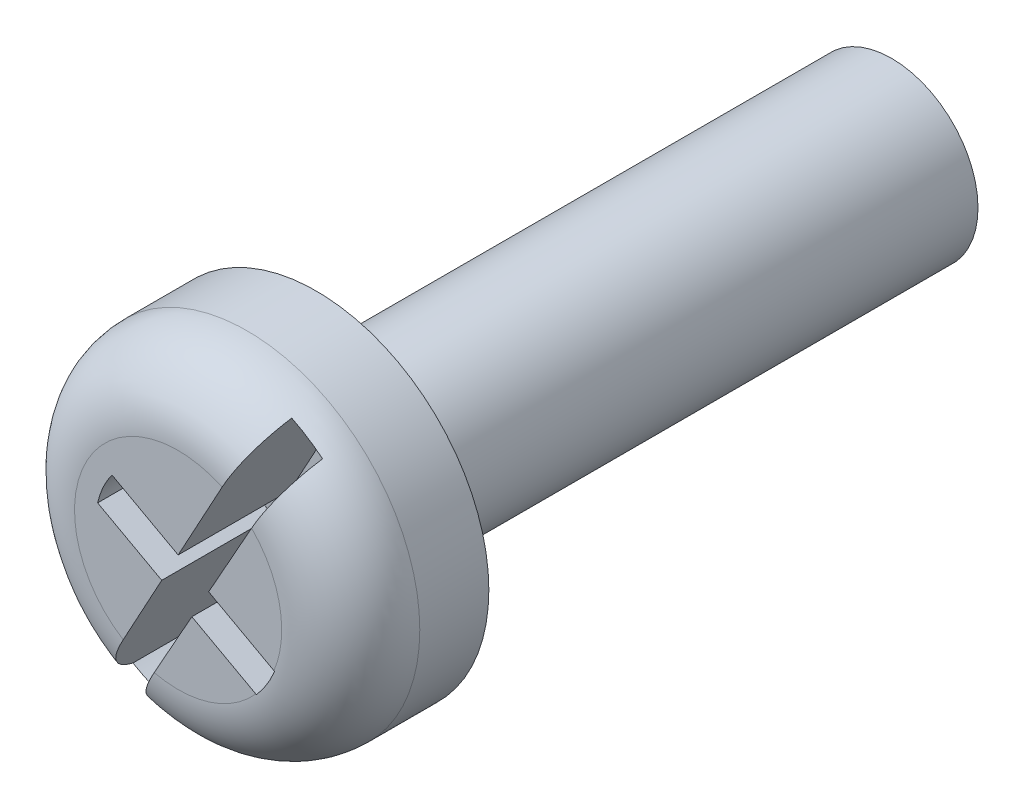
ISO-10303-21;
HEADER;
FILE_DESCRIPTION(('STEP AP214'),'2;1');
FILE_NAME('part.step','',(''),(''),'','','');
FILE_SCHEMA(('AUTOMOTIVE_DESIGN { 1 0 10303 214 1 1 1 1 }'));
ENDSEC;
DATA;
#1=APPLICATION_CONTEXT('core data for automotive mechanical design processes');
#2=APPLICATION_PROTOCOL_DEFINITION('international standard','automotive_design',2000,#1);
#3=PRODUCT_CONTEXT('',#1,'mechanical');
#4=PRODUCT('Part','Part','',(#3));
#5=PRODUCT_RELATED_PRODUCT_CATEGORY('part','',(#4));
#6=PRODUCT_DEFINITION_FORMATION('','',#4);
#7=PRODUCT_DEFINITION_CONTEXT('part definition',#1,'design');
#8=PRODUCT_DEFINITION('design','',#6,#7);
#9=PRODUCT_DEFINITION_SHAPE('','',#8);
#10=(LENGTH_UNIT() NAMED_UNIT(*) SI_UNIT(.MILLI.,.METRE.));
#11=(NAMED_UNIT(*) PLANE_ANGLE_UNIT() SI_UNIT($,.RADIAN.));
#12=(NAMED_UNIT(*) SI_UNIT($,.STERADIAN.) SOLID_ANGLE_UNIT());
#13=UNCERTAINTY_MEASURE_WITH_UNIT(LENGTH_MEASURE(1.E-05),#10,'distance_accuracy_value','');
#14=(GEOMETRIC_REPRESENTATION_CONTEXT(3) GLOBAL_UNCERTAINTY_ASSIGNED_CONTEXT((#13)) GLOBAL_UNIT_ASSIGNED_CONTEXT((#10,
#11,#12)) REPRESENTATION_CONTEXT('',''));
#15=CARTESIAN_POINT('',(0.,0.,0.));
#16=DIRECTION('',(0.,0.,1.));
#17=DIRECTION('',(1.,0.,0.));
#18=AXIS2_PLACEMENT_3D('',#15,#16,#17);
#19=CARTESIAN_POINT('',(-1.86051624597212,2.73214285714287,2.4));
#20=DIRECTION('',(0.,0.,1.));
#21=DIRECTION('',(1.,0.,0.));
#22=AXIS2_PLACEMENT_3D('',#19,#20,#21);
#23=PLANE('',#22);
#24=DIRECTION('',(-0.478292119632489,-0.87820080180871,0.));
#25=VECTOR('',#24,1.);
#26=CARTESIAN_POINT('',(-3.33454353016391,0.250826496084395,2.4));
#27=LINE('',#26,#25);
#28=CARTESIAN_POINT('',(-2.14514294385762,2.43470640062586,2.4));
#29=VERTEX_POINT('',#28);
#30=CARTESIAN_POINT('',(-2.8144800366458,1.20572447213714,2.4));
#31=VERTEX_POINT('',#30);
#32=EDGE_CURVE('E166',#29,#31,#27,.T.);
#33=ORIENTED_EDGE('',*,*,#32,.F.);
#34=DIRECTION('',(0.877616803209732,-0.479362854968896,0.));
#35=VECTOR('',#34,1.);
#36=CARTESIAN_POINT('',(-2.14514294385762,2.43470640062586,2.4));
#37=LINE('',#36,#35);
#38=CARTESIAN_POINT('',(-3.25868789679237,3.04293551135249,2.4));
#39=VERTEX_POINT('',#38);
#40=EDGE_CURVE('E168',#39,#29,#37,.T.);
#41=ORIENTED_EDGE('',*,*,#40,.F.);
#42=CARTESIAN_POINT('',(-1.86051624597212,2.73214285714287,2.4));
#43=DIRECTION('',(0.,0.,1.));
#44=DIRECTION('',(1.,0.,0.));
#45=AXIS2_PLACEMENT_3D('',#42,#43,#44);
#46=CIRCLE('',#45,1.43229746877807);
#47=CARTESIAN_POINT('',(-3.00946383602339,3.58735948138695,2.4));
#48=VERTEX_POINT('',#47);
#49=EDGE_CURVE('E209',#48,#39,#46,.T.);
#50=ORIENTED_EDGE('',*,*,#49,.F.);
#51=DIRECTION('',(-0.87756139574922,0.479464280933086,0.));
#52=VECTOR('',#51,1.);
#53=CARTESIAN_POINT('',(-1.85954831796557,2.95909185285404,2.4));
#54=LINE('',#53,#52);
#55=CARTESIAN_POINT('',(-1.85954831796557,2.95909185285404,2.4));
#56=VERTEX_POINT('',#55);
#57=EDGE_CURVE('E206',#56,#48,#54,.T.);
#58=ORIENTED_EDGE('',*,*,#57,.F.);
#59=DIRECTION('',(-0.478292119632489,-0.87820080180871,0.));
#60=VECTOR('',#59,1.);
#61=CARTESIAN_POINT('',(-1.85954831796557,2.95909185285404,2.4));
#62=LINE('',#61,#60);
#63=CARTESIAN_POINT('',(-1.09571318629089,4.36158333776873,2.4));
#64=VERTEX_POINT('',#63);
#65=EDGE_CURVE('E204',#64,#56,#62,.T.);
#66=ORIENTED_EDGE('',*,*,#65,.F.);
#67=CARTESIAN_POINT('',(-1.86051624597212,2.73214285714287,2.4));
#68=DIRECTION('',(0.,0.,1.));
#69=DIRECTION('',(1.,0.,0.));
#70=AXIS2_PLACEMENT_3D('',#67,#68,#69);
#71=CIRCLE('',#70,1.8);
#72=EDGE_CURVE('E254',#64,#31,#71,.T.);
#73=ORIENTED_EDGE('',*,*,#72,.T.);
#74=EDGE_LOOP('',(#33,#41,#50,#58,#66,#73));
#75=FACE_BOUND('',#74,.T.);
#76=ADVANCED_FACE('F34',(#75),#23,.T.);
#77=DIRECTION('',(0.488945551082672,0.872314305784596,0.));
#78=VECTOR('',#77,1.);
#79=CARTESIAN_POINT('',(-1.32937302466549,2.66942537823253,2.4));
#80=LINE('',#79,#78);
#81=CARTESIAN_POINT('',(-1.32937302466549,2.66942537823253,2.4));
#82=VERTEX_POINT('',#81);
#83=CARTESIAN_POINT('',(-0.583292168991765,4.00048770661469,2.4));
#84=VERTEX_POINT('',#83);
#85=EDGE_CURVE('E202',#82,#84,#80,.T.);
#86=ORIENTED_EDGE('',*,*,#85,.F.);
#87=DIRECTION('',(-0.87756139574922,0.479464280933086,0.));
#88=VECTOR('',#87,1.);
#89=CARTESIAN_POINT('',(-0.183967514701797,2.04362183688296,2.4));
#90=LINE('',#89,#88);
#91=CARTESIAN_POINT('',(-0.194936591049152,2.04961489939557,2.4));
#92=VERTEX_POINT('',#91);
#93=EDGE_CURVE('E200',#92,#82,#90,.T.);
#94=ORIENTED_EDGE('',*,*,#93,.F.);
#95=EDGE_CURVE('E250',#92,#84,#71,.T.);
#96=ORIENTED_EDGE('',*,*,#95,.T.);
#97=EDGE_LOOP('',(#86,#94,#96));
#98=FACE_BOUND('',#97,.T.);
#99=ADVANCED_FACE('F289',(#98),#23,.T.);
#100=CARTESIAN_POINT('',(-1.86051624597212,2.73214285714287,2.4));
#101=DIRECTION('',(0.,0.,-1.));
#102=DIRECTION('',(-1.,0.,0.));
#103=AXIS2_PLACEMENT_3D('',#100,#101,#102);
#104=CYLINDRICAL_SURFACE('',#103,3.);
#105=CARTESIAN_POINT('',(-1.86051624597212,2.73214285714287,1.2));
#106=DIRECTION('',(0.,0.,1.));
#107=DIRECTION('',(1.,0.,0.));
#108=AXIS2_PLACEMENT_3D('',#105,#106,#107);
#109=CIRCLE('',#108,3.);
#110=CARTESIAN_POINT('',(1.13948375402788,2.73214285714287,1.2));
#111=VERTEX_POINT('',#110);
#112=EDGE_CURVE('E255',#111,#111,#109,.F.);
#113=ORIENTED_EDGE('',*,*,#112,.T.);
#114=EDGE_LOOP('',(#113));
#115=FACE_BOUND('',#114,.T.);
#116=CARTESIAN_POINT('',(-1.86051624597212,2.73214285714287,0.));
#117=DIRECTION('',(0.,0.,1.));
#118=DIRECTION('',(1.,0.,0.));
#119=AXIS2_PLACEMENT_3D('',#116,#117,#118);
#120=CIRCLE('',#119,3.);
#121=CARTESIAN_POINT('',(1.13948375402788,2.73214285714287,0.));
#122=VERTEX_POINT('',#121);
#123=EDGE_CURVE('E244',#122,#122,#120,.T.);
#124=ORIENTED_EDGE('',*,*,#123,.T.);
#125=EDGE_LOOP('',(#124));
#126=FACE_BOUND('',#125,.T.);
#127=ADVANCED_FACE('F287',(#115,#126),#104,.T.);
#128=DIRECTION('',(0.877616803209732,-0.479362854968895,0.));
#129=VECTOR('',#128,1.);
#130=CARTESIAN_POINT('',(-0.499159615510704,1.53565425779784,2.4));
#131=LINE('',#130,#129);
#132=CARTESIAN_POINT('',(-1.62131210840641,2.14858489077753,2.4));
#133=VERTEX_POINT('',#132);
#134=CARTESIAN_POINT('',(-0.510336160729363,1.54175899577131,2.4));
#135=VERTEX_POINT('',#134);
#136=EDGE_CURVE('E198',#133,#135,#131,.T.);
#137=ORIENTED_EDGE('',*,*,#136,.F.);
#138=DIRECTION('',(0.488945551082672,0.872314305784596,0.));
#139=VECTOR('',#138,1.);
#140=CARTESIAN_POINT('',(-2.81993360779638,0.0101572502690064,2.4));
#141=LINE('',#140,#139);
#142=CARTESIAN_POINT('',(-2.27591252151725,0.980730303155878,2.4));
#143=VERTEX_POINT('',#142);
#144=EDGE_CURVE('E196',#143,#133,#141,.T.);
#145=ORIENTED_EDGE('',*,*,#144,.F.);
#146=EDGE_CURVE('E253',#143,#135,#71,.T.);
#147=ORIENTED_EDGE('',*,*,#146,.T.);
#148=EDGE_LOOP('',(#137,#145,#147));
#149=FACE_BOUND('',#148,.T.);
#150=ADVANCED_FACE('F284',(#149),#23,.T.);
#151=CARTESIAN_POINT('',(-1.86051624597212,2.73214285714287,0.));
#152=DIRECTION('',(0.,0.,1.));
#153=DIRECTION('',(1.,0.,0.));
#154=AXIS2_PLACEMENT_3D('',#151,#152,#153);
#155=PLANE('',#154);
#156=CARTESIAN_POINT('',(-1.86051624597212,2.73214285714287,0.));
#157=DIRECTION('',(0.,0.,1.));
#158=DIRECTION('',(1.,0.,0.));
#159=AXIS2_PLACEMENT_3D('',#156,#157,#158);
#160=CIRCLE('',#159,1.5);
#161=CARTESIAN_POINT('',(-0.360516245972119,2.73214285714287,0.));
#162=VERTEX_POINT('',#161);
#163=EDGE_CURVE('E247',#162,#162,#160,.F.);
#164=ORIENTED_EDGE('',*,*,#163,.F.);
#165=EDGE_LOOP('',(#164));
#166=FACE_BOUND('',#165,.T.);
#167=ORIENTED_EDGE('',*,*,#123,.F.);
#168=EDGE_LOOP('',(#167));
#169=FACE_BOUND('',#168,.T.);
#170=ADVANCED_FACE('F282',(#166,#169),#155,.F.);
#171=CARTESIAN_POINT('',(-1.86051624597212,2.73214285714287,-10.));
#172=DIRECTION('',(0.,0.,1.));
#173=DIRECTION('',(1.,0.,0.));
#174=AXIS2_PLACEMENT_3D('',#171,#172,#173);
#175=CYLINDRICAL_SURFACE('',#174,1.5);
#176=CARTESIAN_POINT('',(-1.86051624597212,2.73214285714287,-10.));
#177=DIRECTION('',(0.,0.,-1.));
#178=DIRECTION('',(-1.,0.,0.));
#179=AXIS2_PLACEMENT_3D('',#176,#177,#178);
#180=CIRCLE('',#179,1.5);
#181=CARTESIAN_POINT('',(-3.36051624597212,2.73214285714287,-10.));
#182=VERTEX_POINT('',#181);
#183=EDGE_CURVE('E216',#182,#182,#180,.T.);
#184=ORIENTED_EDGE('',*,*,#183,.F.);
#185=EDGE_LOOP('',(#184));
#186=FACE_BOUND('',#185,.T.);
#187=ORIENTED_EDGE('',*,*,#163,.T.);
#188=EDGE_LOOP('',(#187));
#189=FACE_BOUND('',#188,.T.);
#190=ADVANCED_FACE('F278',(#186,#189),#175,.T.);
#191=CARTESIAN_POINT('',(-1.86051624597212,2.73214285714287,-10.));
#192=DIRECTION('',(0.,0.,-1.));
#193=DIRECTION('',(-1.,0.,0.));
#194=AXIS2_PLACEMENT_3D('',#191,#192,#193);
#195=PLANE('',#194);
#196=ORIENTED_EDGE('',*,*,#183,.T.);
#197=EDGE_LOOP('',(#196));
#198=FACE_BOUND('',#197,.T.);
#199=ADVANCED_FACE('F275',(#198),#195,.T.);
#200=CARTESIAN_POINT('',(-1.86051624597212,2.73214285714287,1.2));
#201=DIRECTION('',(0.,0.,1.));
#202=DIRECTION('',(1.,0.,0.));
#203=AXIS2_PLACEMENT_3D('',#200,#201,#202);
#204=TOROIDAL_SURFACE('',#203,1.8,1.2);
#205=CARTESIAN_POINT('',(-0.575540767315494,5.31668131382147,1.70975429270533));
#206=CARTESIAN_POINT('',(-0.5824043740871,5.3040789214284,1.74031456902629));
#207=CARTESIAN_POINT('',(-0.58988200536983,5.29034910753732,1.77025412843296));
#208=CARTESIAN_POINT('',(-0.606016263850412,5.26072470405536,1.82870871238285));
#209=CARTESIAN_POINT('',(-0.614672831189766,5.24483022437174,1.85722380915036));
#210=CARTESIAN_POINT('',(-0.642308509018158,5.19408785703759,1.94027220578123));
#211=CARTESIAN_POINT('',(-0.6629762437161,5.15613945596996,1.99240919048908));
#212=CARTESIAN_POINT('',(-0.708203159379022,5.07309749903989,2.08868631517981));
#213=CARTESIAN_POINT('',(-0.732764089691729,5.02800073116848,2.1328228410772));
#214=CARTESIAN_POINT('',(-0.785077689775711,4.931946784943,2.21185265354796));
#215=CARTESIAN_POINT('',(-0.812829752078776,4.88099072197227,2.24674769517889));
#216=CARTESIAN_POINT('',(-0.870755055483799,4.77463302589651,2.30632883547805));
#217=CARTESIAN_POINT('',(-0.900929651552919,4.71922890491179,2.33100917270618));
#218=CARTESIAN_POINT('',(-0.96283568336023,4.6055621214997,2.3694469225507));
#219=CARTESIAN_POINT('',(-0.994567368093604,4.54729900188777,2.38320258211041));
#220=CARTESIAN_POINT('',(-1.05872386347642,4.42950010164723,2.39941483191493));
#221=CARTESIAN_POINT('',(-1.09114948115231,4.36996283922278,2.40185745763308));
#222=CARTESIAN_POINT('',(-1.15573526747496,4.25137571013191,2.3953503202161));
#223=CARTESIAN_POINT('',(-1.18789545531375,4.19232580822668,2.38640138814567));
#224=CARTESIAN_POINT('',(-1.25111142223883,4.07625382927923,2.35735083248507));
#225=CARTESIAN_POINT('',(-1.28216478936063,4.01923618088856,2.33722626866415));
#226=CARTESIAN_POINT('',(-1.34222441899033,3.90895960987239,2.28639254421336));
#227=CARTESIAN_POINT('',(-1.37123050343914,3.85570101418436,2.25568246428877));
#228=CARTESIAN_POINT('',(-1.42645974489832,3.75429360615512,2.18445449366384));
#229=CARTESIAN_POINT('',(-1.45267457095233,3.7061600904334,2.14390836466459));
#230=CARTESIAN_POINT('',(-1.50148430909094,3.6165396484275,2.05421363754392));
#231=CARTESIAN_POINT('',(-1.52407946375269,3.57505227674305,2.00506561635217));
#232=CARTESIAN_POINT('',(-1.56505668794341,3.49981325510113,1.89942416088343));
#233=CARTESIAN_POINT('',(-1.58342918956016,3.46607917296016,1.84291449103487));
#234=CARTESIAN_POINT('',(-1.61535277583557,3.40746369945995,1.72423224566163));
#235=CARTESIAN_POINT('',(-1.62890390546596,3.38258222552731,1.66205972296445));
#236=CARTESIAN_POINT('',(-1.65068064383632,3.3425975627812,1.53419605152068));
#237=CARTESIAN_POINT('',(-1.65894166858414,3.32742934599587,1.46853155927476));
#238=CARTESIAN_POINT('',(-1.66723338993673,3.31220476661996,1.36857431614967));
#239=CARTESIAN_POINT('',(-1.66931401785529,3.30838448810952,1.33497508943135));
#240=CARTESIAN_POINT('',(-1.67209007621539,3.30328731720154,1.26752282072818));
#241=CARTESIAN_POINT('',(-1.67278531621524,3.30201077447743,1.23366974448996));
#242=CARTESIAN_POINT('',(-1.67278220669648,3.302016483921,1.1998));
#243=B_SPLINE_CURVE_WITH_KNOTS('',3,(#205,#206,#207,#208,#209,#210,#211,#212,#213,#214,#215,
#216,#217,#218,#219,#220,#221,#222,#223,#224,#225,#226,#227,#228,#229,#230,#231,#232,#233,#234,
#235,#236,#237,#238,#239,#240,#241,#242),.UNSPECIFIED.,.F.,.F.,(4,2,2,2,2,2,2,2,2,2,2,2,2,2,2,2,
2,2,4),(0.,0.101223158894359,0.202441180267574,0.404547966509414,0.606745825117994,
0.808905256591363,1.01117855796459,1.21348431109243,1.41603971895592,1.61858035035038,
1.82153828216889,2.02451384422666,2.22807917195367,2.43163085176484,2.63563930015266,
2.83964584558596,3.04227192850753,3.1438024334223,3.24534689421735),.UNSPECIFIED.);
#244=CARTESIAN_POINT('',(-0.575649692772779,5.31648131382147,1.71023901109821));
#245=VERTEX_POINT('',#244);
#246=EDGE_CURVE('E11',#245,#64,#243,.T.);
#247=ORIENTED_EDGE('',*,*,#246,.F.);
#248=CARTESIAN_POINT('',(-1.86051624597212,2.73214285714287,1.71023901109821));
#249=DIRECTION('',(0.,0.,-1.));
#250=DIRECTION('',(-1.,0.,0.));
#251=AXIS2_PLACEMENT_3D('',#248,#249,#250);
#252=CIRCLE('',#251,2.88611976851244);
#253=CARTESIAN_POINT('',(-0.0392710827126332,4.97106075950156,1.71023901109827));
#254=VERTEX_POINT('',#253);
#255=EDGE_CURVE('E47',#254,#245,#252,.F.);
#256=ORIENTED_EDGE('',*,*,#255,.F.);
#257=CARTESIAN_POINT('',(-1.26309170389054,2.78767605909107,1.1998));
#258=CARTESIAN_POINT('',(-1.2631127720155,2.78763847202896,1.22576998040815));
#259=CARTESIAN_POINT('',(-1.26237301012876,2.78895826085872,1.25170198029709));
#260=CARTESIAN_POINT('',(-1.25952072671015,2.79404694123365,1.30315668634531));
#261=CARTESIAN_POINT('',(-1.25741325248622,2.79780682801559,1.32868054522842));
#262=CARTESIAN_POINT('',(-1.24932506804159,2.81223673536059,1.40375196214292));
#263=CARTESIAN_POINT('',(-1.24157094586872,2.8260706513973,1.45250594024511));
#264=CARTESIAN_POINT('',(-1.22556622491573,2.8546242337266,1.53282213605265));
#265=CARTESIAN_POINT('',(-1.21816574900715,2.86782721919272,1.56514626066184));
#266=CARTESIAN_POINT('',(-1.20205095375697,2.89657718204726,1.62840310857575));
#267=CARTESIAN_POINT('',(-1.19333633706057,2.9121246899382,1.65933551490998));
#268=CARTESIAN_POINT('',(-1.16542086668087,2.96192791263038,1.75044821489817));
#269=CARTESIAN_POINT('',(-1.14454383968645,2.99917404212099,1.80849742576797));
#270=CARTESIAN_POINT('',(-1.09772220899005,3.08270722528668,1.92199684801045));
#271=CARTESIAN_POINT('',(-1.07153445687538,3.12942807335531,1.9770243073677));
#272=CARTESIAN_POINT('',(-1.01564250198845,3.22914337236595,2.07869204050147));
#273=CARTESIAN_POINT('',(-0.985948470618887,3.28211967678826,2.12535563158695));
#274=CARTESIAN_POINT('',(-0.918223441287482,3.40294603836298,2.21601487520697));
#275=CARTESIAN_POINT('',(-0.879627663676285,3.47180370334956,2.25827105625763));
#276=CARTESIAN_POINT('',(-0.799196938468586,3.61529794737724,2.32733623557769));
#277=CARTESIAN_POINT('',(-0.75735970921051,3.68993859706798,2.35413423868104));
#278=CARTESIAN_POINT('',(-0.676058999745624,3.83498495607384,2.38861679562639));
#279=CARTESIAN_POINT('',(-0.636757731729013,3.90510126708322,2.39790034547785));
#280=CARTESIAN_POINT('',(-0.558000185780485,4.04561043802723,2.40146077706672));
#281=CARTESIAN_POINT('',(-0.518544054122394,4.11600303699876,2.39574945908726));
#282=CARTESIAN_POINT('',(-0.444261504767299,4.24852848963682,2.3702843287041));
#283=CARTESIAN_POINT('',(-0.409330772893901,4.31084744735557,2.35179428040256));
#284=CARTESIAN_POINT('',(-0.341616033942729,4.43165545014603,2.30246954631037));
#285=CARTESIAN_POINT('',(-0.308831410977736,4.49014559400518,2.27163842037526));
#286=CARTESIAN_POINT('',(-0.248009519737374,4.59865625683126,2.20022273119116));
#287=CARTESIAN_POINT('',(-0.219819428476118,4.64894942308283,2.16018125447389));
#288=CARTESIAN_POINT('',(-0.167249114151315,4.74273867455178,2.0707446602969));
#289=CARTESIAN_POINT('',(-0.142866729021386,4.78623861705231,2.02135488642782));
#290=CARTESIAN_POINT('',(-0.10452820364559,4.85463732540325,1.92879061961627));
#291=CARTESIAN_POINT('',(-0.08951899805589,4.88141483616159,1.88741844310844));
#292=CARTESIAN_POINT('',(-0.0622349441551543,4.93009156608522,1.80110482457957));
#293=CARTESIAN_POINT('',(-0.0499580968395804,4.95199435161951,1.75616602478609));
#294=CARTESIAN_POINT('',(-0.0391589796443221,4.97126075950155,1.70975788936457));
#295=B_SPLINE_CURVE_WITH_KNOTS('',3,(#257,#258,#259,#260,#261,#262,#263,#264,#265,#266,#267,
#268,#269,#270,#271,#272,#273,#274,#275,#276,#277,#278,#279,#280,#281,#282,#283,#284,#285,#286,
#287,#288,#289,#290,#291,#292,#293,#294),.UNSPECIFIED.,.F.,.F.,(4,2,2,2,2,2,2,2,2,2,2,2,2,2,2,2,
2,2,4),(0.,0.0778006917118378,0.155315893483458,0.308266870217621,0.415234357270093,
0.522226084613864,0.737655839714488,0.967269406588131,1.19623253348757,1.46333863997643,
1.73063450143458,1.97205770050909,2.21329096739737,2.43355558113201,2.65375670399323,
2.86332090395877,3.07276567449364,3.22690773757732,3.38093665626108),.UNSPECIFIED.);
#296=EDGE_CURVE('E355',#84,#254,#295,.T.);
#297=ORIENTED_EDGE('',*,*,#296,.F.);
#298=ORIENTED_EDGE('',*,*,#95,.F.);
#299=CARTESIAN_POINT('',(-0.183767514701797,2.04351256492016,2.39993332802436));
#300=CARTESIAN_POINT('',(-0.217782658736837,2.06209707268747,2.40033863472729));
#301=CARTESIAN_POINT('',(-0.251792157132213,2.08067849590415,2.39888813616958));
#302=CARTESIAN_POINT('',(-0.319534364168039,2.11769011553849,2.39230484226138));
#303=CARTESIAN_POINT('',(-0.353267082920302,2.13612031748085,2.38717218204555));
#304=CARTESIAN_POINT('',(-0.453400795391146,2.19082935399903,2.36634775777888));
#305=CARTESIAN_POINT('',(-0.519000364428353,2.22667032233503,2.34523208484704));
#306=CARTESIAN_POINT('',(-0.638425774554932,2.29191956719567,2.2925053228282));
#307=CARTESIAN_POINT('',(-0.69274889876274,2.32159953923238,2.26232665392895));
#308=CARTESIAN_POINT('',(-0.796253299526463,2.37815018437923,2.19212147821412));
#309=CARTESIAN_POINT('',(-0.845435603131863,2.40502141862793,2.1520969438157));
#310=CARTESIAN_POINT('',(-0.93783514695995,2.45550481620521,2.0628344484937));
#311=CARTESIAN_POINT('',(-0.980978593060597,2.47907666139099,2.01349735883978));
#312=CARTESIAN_POINT('',(-1.05943191653211,2.5219404046086,1.90725218211608));
#313=CARTESIAN_POINT('',(-1.09473743753789,2.5412299224976,1.85033991268358));
#314=CARTESIAN_POINT('',(-1.15640863612218,2.57492458708373,1.73042207813507));
#315=CARTESIAN_POINT('',(-1.18276106492887,2.58932249518434,1.66740765860267));
#316=CARTESIAN_POINT('',(-1.22535753184498,2.61259549292461,1.53714360818663));
#317=CARTESIAN_POINT('',(-1.24161903914605,2.62148012702857,1.46990151973345));
#318=CARTESIAN_POINT('',(-1.25768366139594,2.6302571910526,1.36830312947122));
#319=CARTESIAN_POINT('',(-1.26165056048128,2.63242454529892,1.33474662578359));
#320=CARTESIAN_POINT('',(-1.266942961413,2.63531610048746,1.26739967422531));
#321=CARTESIAN_POINT('',(-1.26827119793696,2.6360417955476,1.23360950501902));
#322=CARTESIAN_POINT('',(-1.26826312586215,2.63603738529031,1.1998));
#323=B_SPLINE_CURVE_WITH_KNOTS('',3,(#299,#300,#301,#302,#303,#304,#305,#306,#307,#308,#309,
#310,#311,#312,#313,#314,#315,#316,#317,#318,#319,#320,#321,#322),.UNSPECIFIED.,.F.,.F.,(4,2,2,
2,2,2,2,2,2,2,2,4),(0.,0.116194057201358,0.232383850320403,0.463878668865414,0.66956690126712,
0.875213961759851,1.08318799595766,1.29127733555275,1.49967327769664,1.70770743525587,
1.80916908072369,1.91052551761236),.UNSPECIFIED.);
#324=CARTESIAN_POINT('',(-0.183967514701797,2.04362183688296,2.39993569454367));
#325=VERTEX_POINT('',#324);
#326=EDGE_CURVE('E360',#325,#92,#323,.T.);
#327=ORIENTED_EDGE('',*,*,#326,.F.);
#328=CARTESIAN_POINT('',(-1.86051624597212,2.73214285714287,2.39993569454367));
#329=DIRECTION('',(0.,0.,-1.));
#330=DIRECTION('',(-1.,0.,0.));
#331=AXIS2_PLACEMENT_3D('',#328,#329,#330);
#332=CIRCLE('',#331,1.81242292075108);
#333=CARTESIAN_POINT('',(-0.499159615510704,1.53565425779784,2.39993569454353));
#334=VERTEX_POINT('',#333);
#335=EDGE_CURVE('E313',#334,#325,#332,.F.);
#336=ORIENTED_EDGE('',*,*,#335,.F.);
#337=CARTESIAN_POINT('',(-1.62151210840638,2.14869413272758,1.46884807485071));
#338=CARTESIAN_POINT('',(-1.61337014202699,2.14424691130428,1.50015816020714));
#339=CARTESIAN_POINT('',(-1.60395340171439,2.13910339592918,1.53100343533154));
#340=CARTESIAN_POINT('',(-1.58283284504561,2.12756714194424,1.59162369108894));
#341=CARTESIAN_POINT('',(-1.57113159541627,2.12117580530562,1.62139982889169));
#342=CARTESIAN_POINT('',(-1.53304521941817,2.10037265538062,1.70882633846756));
#343=CARTESIAN_POINT('',(-1.50362091999362,2.08430081613823,1.76478080452301));
#344=CARTESIAN_POINT('',(-1.43685873996878,2.0478346624552,1.87328351003643));
#345=CARTESIAN_POINT('',(-1.39926537871097,2.02730080198841,1.92562519772884));
#346=CARTESIAN_POINT('',(-1.31781577832807,1.98281223609858,2.02368680610002));
#347=CARTESIAN_POINT('',(-1.27395030371921,1.95885248616424,2.06939675818379));
#348=CARTESIAN_POINT('',(-1.17347767984285,1.90397335936148,2.15971584324997));
#349=CARTESIAN_POINT('',(-1.11595236120694,1.87255246943155,2.2030105340935));
#350=CARTESIAN_POINT('',(-0.99525776678779,1.80662790514737,2.27762475239334));
#351=CARTESIAN_POINT('',(-0.93209357834735,1.77212700954936,2.30895494207597));
#352=CARTESIAN_POINT('',(-0.807854099588225,1.70426619487488,2.35608316652604));
#353=CARTESIAN_POINT('',(-0.747121541030133,1.67109347922781,2.37304527651785));
#354=CARTESIAN_POINT('',(-0.654777795629045,1.6206544251075,2.38976872479177));
#355=CARTESIAN_POINT('',(-0.623736747104048,1.6036995017426,2.39388947843407));
#356=CARTESIAN_POINT('',(-0.561450947954723,1.56967839093998,2.39915564694617));
#357=CARTESIAN_POINT('',(-0.530206133741795,1.55261216876954,2.40030008361231));
#358=CARTESIAN_POINT('',(-0.498959615510704,1.53554501584778,2.39993337202856));
#359=B_SPLINE_CURVE_WITH_KNOTS('',3,(#337,#338,#339,#340,#341,#342,#343,#344,#345,#346,#347,
#348,#349,#350,#351,#352,#353,#354,#355,#356,#357,#358),.UNSPECIFIED.,.F.,.F.,(4,2,2,2,2,2,2,2,
2,2,4),(0.,0.0978774872130326,0.195645631969167,0.390542213792294,0.592750808490968,
0.795260275068813,1.02975854366474,1.26404734754404,1.47677448793309,1.58349124104491,
1.69024306351729),.UNSPECIFIED.);
#360=EDGE_CURVE('E312',#135,#334,#359,.T.);
#361=ORIENTED_EDGE('',*,*,#360,.F.);
#362=ORIENTED_EDGE('',*,*,#146,.F.);
#363=CARTESIAN_POINT('',(-2.8200457108647,0.00995725026900685,1.70975788936454));
#364=CARTESIAN_POINT('',(-2.81294284402451,0.022629279584052,1.74025937821588));
#365=CARTESIAN_POINT('',(-2.80520776699475,0.0364292177048946,1.77012651441064));
#366=CARTESIAN_POINT('',(-2.78852805075133,0.0661870405613481,1.82840858711255));
#367=CARTESIAN_POINT('',(-2.77958354431484,0.0821446884128344,1.85682368256077));
#368=CARTESIAN_POINT('',(-2.75105867197416,0.133035128377685,1.93950073195886));
#369=CARTESIAN_POINT('',(-2.72975432624299,0.171043625470118,1.99133402140313));
#370=CARTESIAN_POINT('',(-2.68321245334617,0.254077700442272,2.08695288085192));
#371=CARTESIAN_POINT('',(-2.65797425673365,0.299104472663766,2.13073707832536));
#372=CARTESIAN_POINT('',(-2.60429647966901,0.394869517938271,2.20913797564933));
#373=CARTESIAN_POINT('',(-2.57585694671416,0.445607706252732,2.24375481148769));
#374=CARTESIAN_POINT('',(-2.51624584523596,0.551958232375456,2.30332144687179));
#375=CARTESIAN_POINT('',(-2.48504637325386,0.607620351976805,2.32815425531122));
#376=CARTESIAN_POINT('',(-2.42108372755138,0.721734348430112,2.36706399353599));
#377=CARTESIAN_POINT('',(-2.38832028354668,0.780186707488876,2.38113905697485));
#378=CARTESIAN_POINT('',(-2.3212205298552,0.899897531997037,2.39860255480028));
#379=CARTESIAN_POINT('',(-2.28686565282517,0.961189122932676,2.40169129859643));
#380=CARTESIAN_POINT('',(-2.21836196694208,1.08340466423881,2.39656212253163));
#381=CARTESIAN_POINT('',(-2.18421320380919,1.14432853304119,2.38834178043095));
#382=CARTESIAN_POINT('',(-2.11541314916736,1.26707281769608,2.36052733205186));
#383=CARTESIAN_POINT('',(-2.08081091742779,1.32880570736378,2.34042775974803));
#384=CARTESIAN_POINT('',(-2.01358345624662,1.4487443712908,2.28946888113319));
#385=CARTESIAN_POINT('',(-1.98095779999344,1.5069509070129,2.25861190751046));
#386=CARTESIAN_POINT('',(-1.91595930201837,1.6229129390073,2.1846794657163));
#387=CARTESIAN_POINT('',(-1.88378883195749,1.68030738956684,2.14086134133571));
#388=CARTESIAN_POINT('',(-1.82299040998259,1.78877618152209,2.04373589253331));
#389=CARTESIAN_POINT('',(-1.79437078554514,1.83983566609596,1.99040695083443));
#390=CARTESIAN_POINT('',(-1.74170793806781,1.93379000341657,1.87684814417621));
#391=CARTESIAN_POINT('',(-1.71758927738487,1.97681944238683,1.81676563764669));
#392=CARTESIAN_POINT('',(-1.68499473938053,2.03497046089731,1.72173769517997));
#393=CARTESIAN_POINT('',(-1.67474067883886,2.05326444819932,1.68930008901254));
#394=CARTESIAN_POINT('',(-1.65560220426437,2.0874088741487,1.62278687505944));
#395=CARTESIAN_POINT('',(-1.64671642517575,2.10326174815456,1.58871294486205));
#396=CARTESIAN_POINT('',(-1.6354763758506,2.12331481091859,1.53995134726292));
#397=CARTESIAN_POINT('',(-1.63241040549437,2.12878472427997,1.52594181495768));
#398=CARTESIAN_POINT('',(-1.62657512176459,2.13919529344156,1.49766364899058));
#399=CARTESIAN_POINT('',(-1.62380587038182,2.14413583864574,1.48339496191127));
#400=CARTESIAN_POINT('',(-1.6212000053383,2.14878489077715,1.46899770049256));
#401=B_SPLINE_CURVE_WITH_KNOTS('',3,(#363,#364,#365,#366,#367,#368,#369,#370,#371,#372,#373,
#374,#375,#376,#377,#378,#379,#380,#381,#382,#383,#384,#385,#386,#387,#388,#389,#390,#391,#392,
#393,#394,#395,#396,#397,#398,#399,#400),.UNSPECIFIED.,.F.,.F.,(4,2,2,2,2,2,2,2,2,2,2,2,2,2,2,2,
2,2,4),(0.,0.101288992601227,0.202566874207223,0.404664504390113,0.606796564357891,
0.808925625748703,1.01340315711687,1.21791615496524,1.42796691929092,1.63806268040327,
1.85781625970006,2.07752221615008,2.31370147648449,2.5504245572661,2.78272989816584,
2.89851304910329,3.0141799308455,3.06021461907438,3.10625890623177),.UNSPECIFIED.);
#402=CARTESIAN_POINT('',(-2.81993360779156,0.0101572502776019,1.71023901111888));
#403=VERTEX_POINT('',#402);
#404=EDGE_CURVE('E258',#403,#143,#401,.T.);
#405=ORIENTED_EDGE('',*,*,#404,.F.);
#406=CARTESIAN_POINT('',(-1.86051624597212,2.73214285714287,1.71023901109822));
#407=DIRECTION('',(0.,0.,-1.));
#408=DIRECTION('',(-1.,0.,0.));
#409=AXIS2_PLACEMENT_3D('',#406,#407,#408);
#410=CIRCLE('',#409,2.88611976851244);
#411=CARTESIAN_POINT('',(-3.33454353016391,0.250826496084395,1.71023901109839));
#412=VERTEX_POINT('',#411);
#413=EDGE_CURVE('E149',#412,#403,#410,.F.);
#414=ORIENTED_EDGE('',*,*,#413,.F.);
#415=CARTESIAN_POINT('',(-2.23741101624021,2.26529132598487,1.1998));
#416=CARTESIAN_POINT('',(-2.23740798207602,2.26529689706855,1.23311773914182));
#417=CARTESIAN_POINT('',(-2.23808067093128,2.26406176090843,1.26641957114974));
#418=CARTESIAN_POINT('',(-2.24076710911818,2.25912914321957,1.33278175952951));
#419=CARTESIAN_POINT('',(-2.242780689134,2.25543197257465,1.36584214585618));
#420=CARTESIAN_POINT('',(-2.25080606757614,2.24069643022843,1.46421986667473));
#421=CARTESIAN_POINT('',(-2.25880259100748,2.22601386908886,1.52887702678378));
#422=CARTESIAN_POINT('',(-2.27983915454845,2.18738825471918,1.65459016266913));
#423=CARTESIAN_POINT('',(-2.29288843169437,2.16342824119987,1.71563930558337));
#424=CARTESIAN_POINT('',(-2.32363131516378,2.10698067745266,1.83240079175109));
#425=CARTESIAN_POINT('',(-2.34132519302719,2.07449262864539,1.88811282271796));
#426=CARTESIAN_POINT('',(-2.38115513632148,2.00136015018449,1.99348291171297));
#427=CARTESIAN_POINT('',(-2.40335437218142,1.96059973216481,2.04303659878605));
#428=CARTESIAN_POINT('',(-2.4513978021071,1.87238632251299,2.13371393052453));
#429=CARTESIAN_POINT('',(-2.47724247281079,1.82493245571732,2.17483647109585));
#430=CARTESIAN_POINT('',(-2.53202000366664,1.72435444168758,2.24770555401301));
#431=CARTESIAN_POINT('',(-2.5609706987514,1.67119754741156,2.27939351984365));
#432=CARTESIAN_POINT('',(-2.62100717148868,1.5609634951839,2.3321349510837));
#433=CARTESIAN_POINT('',(-2.65209280048278,1.50388661018668,2.35318915608555));
#434=CARTESIAN_POINT('',(-2.715459985346,1.38753697725104,2.38402091071262));
#435=CARTESIAN_POINT('',(-2.74773931345678,1.32826831973999,2.39381847050695));
#436=CARTESIAN_POINT('',(-2.81262891214323,1.20912335527922,2.40190903095553));
#437=CARTESIAN_POINT('',(-2.84523920539102,1.1492470067008,2.40020123807361));
#438=CARTESIAN_POINT('',(-2.90976172307835,1.03077604629428,2.3853359072085));
#439=CARTESIAN_POINT('',(-2.94167569398232,0.972178227751287,2.37221150496673));
#440=CARTESIAN_POINT('',(-3.00398675295645,0.857767766640874,2.33492525045804));
#441=CARTESIAN_POINT('',(-3.03438411411032,0.801954622659517,2.31076539327067));
#442=CARTESIAN_POINT('',(-3.09273596313708,0.6948137384616,2.2521514303079));
#443=CARTESIAN_POINT('',(-3.12069564895239,0.64347645420905,2.21771995706866));
#444=CARTESIAN_POINT('',(-3.1734523737464,0.546608878697876,2.13952114974382));
#445=CARTESIAN_POINT('',(-3.19824869151269,0.501079911670375,2.09575169275951));
#446=CARTESIAN_POINT('',(-3.2445007498667,0.416155671724698,1.99898020102851));
#447=CARTESIAN_POINT('',(-3.2658668259731,0.376925033380575,1.94578943219456));
#448=CARTESIAN_POINT('',(-3.29438735791881,0.324557969415617,1.86087349664456));
#449=CARTESIAN_POINT('',(-3.30331296750969,0.308169496393382,1.83168275144308));
#450=CARTESIAN_POINT('',(-3.31992520204965,0.277667472433556,1.77179737413023));
#451=CARTESIAN_POINT('',(-3.32761178275446,0.263554002733655,1.74110268836594));
#452=CARTESIAN_POINT('',(-3.3346524556212,0.250626496084396,1.70975429270533));
#453=B_SPLINE_CURVE_WITH_KNOTS('',3,(#415,#416,#417,#418,#419,#420,#421,#422,#423,#424,#425,
#426,#427,#428,#429,#430,#431,#432,#433,#434,#435,#436,#437,#438,#439,#440,#441,#442,#443,#444,
#445,#446,#447,#448,#449,#450,#451,#452),.UNSPECIFIED.,.F.,.F.,(4,2,2,2,2,2,2,2,2,2,2,2,2,2,2,2,
2,2,4),(0.,0.0998914587792622,0.199770306544799,0.39910369637716,0.59880322511113,
0.798514431593275,1.00124780839576,1.20400771705243,1.40800143848499,1.61198096992408,
1.81559733711599,2.01922774808509,2.22226910362057,2.42527376620348,2.62783439007704,
2.83044111327975,3.03769485368784,3.14152109707258,3.24535104714929),.UNSPECIFIED.);
#454=EDGE_CURVE('E62',#31,#412,#453,.T.);
#455=ORIENTED_EDGE('',*,*,#454,.F.);
#456=ORIENTED_EDGE('',*,*,#72,.F.);
#457=EDGE_LOOP('',(#247,#256,#297,#298,#327,#336,#361,#362,#405,#414,#455,#456));
#458=FACE_BOUND('',#457,.T.);
#459=ORIENTED_EDGE('',*,*,#112,.F.);
#460=EDGE_LOOP('',(#459));
#461=FACE_BOUND('',#460,.T.);
#462=ADVANCED_FACE('F36',(#458,#461),#204,.T.);
#463=CARTESIAN_POINT('',(-1.86051624597212,2.73214285714287,0.46));
#464=DIRECTION('',(0.,0.,1.));
#465=DIRECTION('',(1.,0.,0.));
#466=AXIS2_PLACEMENT_3D('',#463,#464,#465);
#467=CYLINDRICAL_SURFACE('',#466,2.88611976851244);
#468=ORIENTED_EDGE('',*,*,#413,.T.);
#469=DIRECTION('',(0.,0.,1.));
#470=VECTOR('',#469,1.);
#471=CARTESIAN_POINT('',(-2.81993360779638,0.0101572502690064,0.46));
#472=LINE('',#471,#470);
#473=CARTESIAN_POINT('',(-2.81993360779638,0.0101572502690064,0.46));
#474=VERTEX_POINT('',#473);
#475=EDGE_CURVE('E54',#474,#403,#472,.T.);
#476=ORIENTED_EDGE('',*,*,#475,.F.);
#477=CARTESIAN_POINT('',(-1.86051624597212,2.73214285714287,0.46));
#478=DIRECTION('',(0.,0.,1.));
#479=DIRECTION('',(1.,0.,0.));
#480=AXIS2_PLACEMENT_3D('',#477,#478,#479);
#481=CIRCLE('',#480,2.88611976851244);
#482=CARTESIAN_POINT('',(-3.33454353016391,0.250826496084395,0.46));
#483=VERTEX_POINT('',#482);
#484=EDGE_CURVE('E146',#483,#474,#481,.T.);
#485=ORIENTED_EDGE('',*,*,#484,.F.);
#486=DIRECTION('',(0.,0.,1.));
#487=VECTOR('',#486,1.);
#488=CARTESIAN_POINT('',(-3.33454353016391,0.250826496084395,0.46));
#489=LINE('',#488,#487);
#490=EDGE_CURVE('E214',#483,#412,#489,.T.);
#491=ORIENTED_EDGE('',*,*,#490,.T.);
#492=EDGE_LOOP('',(#468,#476,#485,#491));
#493=FACE_BOUND('',#492,.T.);
#494=ADVANCED_FACE('F144',(#493),#467,.F.);
#495=CARTESIAN_POINT('',(-3.33454353016391,0.250826496084395,0.46));
#496=DIRECTION('',(-0.87820080180871,0.478292119632489,0.));
#497=DIRECTION('',(-0.478292119632489,-0.87820080180871,0.));
#498=AXIS2_PLACEMENT_3D('',#495,#496,#497);
#499=PLANE('',#498);
#500=ORIENTED_EDGE('',*,*,#454,.T.);
#501=ORIENTED_EDGE('',*,*,#490,.F.);
#502=DIRECTION('',(-0.478292119632489,-0.87820080180871,0.));
#503=VECTOR('',#502,1.);
#504=CARTESIAN_POINT('',(-3.33454353016391,0.250826496084395,0.46));
#505=LINE('',#504,#503);
#506=CARTESIAN_POINT('',(-2.14514294385762,2.43470640062586,0.46));
#507=VERTEX_POINT('',#506);
#508=EDGE_CURVE('E152',#507,#483,#505,.T.);
#509=ORIENTED_EDGE('',*,*,#508,.F.);
#510=DIRECTION('',(0.,0.,1.));
#511=VECTOR('',#510,1.);
#512=CARTESIAN_POINT('',(-2.14514294385762,2.43470640062586,0.46));
#513=LINE('',#512,#511);
#514=EDGE_CURVE('E217',#507,#29,#513,.T.);
#515=ORIENTED_EDGE('',*,*,#514,.T.);
#516=ORIENTED_EDGE('',*,*,#32,.T.);
#517=EDGE_LOOP('',(#500,#501,#509,#515,#516));
#518=FACE_BOUND('',#517,.T.);
#519=ADVANCED_FACE('F274',(#518),#499,.F.);
#520=CARTESIAN_POINT('',(-2.14514294385762,2.43470640062586,0.46));
#521=DIRECTION('',(-0.479362854968896,-0.877616803209732,0.));
#522=DIRECTION('',(0.877616803209732,-0.479362854968896,0.));
#523=AXIS2_PLACEMENT_3D('',#520,#521,#522);
#524=PLANE('',#523);
#525=ORIENTED_EDGE('',*,*,#40,.T.);
#526=ORIENTED_EDGE('',*,*,#514,.F.);
#527=DIRECTION('',(0.877616803209732,-0.479362854968896,0.));
#528=VECTOR('',#527,1.);
#529=CARTESIAN_POINT('',(-2.14514294385762,2.43470640062586,0.46));
#530=LINE('',#529,#528);
#531=CARTESIAN_POINT('',(-3.25868789679237,3.04293551135249,0.46));
#532=VERTEX_POINT('',#531);
#533=EDGE_CURVE('E193',#532,#507,#530,.T.);
#534=ORIENTED_EDGE('',*,*,#533,.F.);
#535=DIRECTION('',(0.,0.,1.));
#536=VECTOR('',#535,1.);
#537=CARTESIAN_POINT('',(-3.25868789679237,3.04293551135249,0.46));
#538=LINE('',#537,#536);
#539=EDGE_CURVE('E219',#532,#39,#538,.T.);
#540=ORIENTED_EDGE('',*,*,#539,.T.);
#541=EDGE_LOOP('',(#525,#526,#534,#540));
#542=FACE_BOUND('',#541,.T.);
#543=ADVANCED_FACE('F327',(#542),#524,.F.);
#544=CARTESIAN_POINT('',(-1.86051624597212,2.73214285714287,0.46));
#545=DIRECTION('',(0.,0.,1.));
#546=DIRECTION('',(1.,0.,0.));
#547=AXIS2_PLACEMENT_3D('',#544,#545,#546);
#548=CYLINDRICAL_SURFACE('',#547,1.43229746877807);
#549=ORIENTED_EDGE('',*,*,#49,.T.);
#550=ORIENTED_EDGE('',*,*,#539,.F.);
#551=CARTESIAN_POINT('',(-1.86051624597212,2.73214285714287,0.46));
#552=DIRECTION('',(0.,0.,1.));
#553=DIRECTION('',(1.,0.,0.));
#554=AXIS2_PLACEMENT_3D('',#551,#552,#553);
#555=CIRCLE('',#554,1.43229746877807);
#556=CARTESIAN_POINT('',(-3.00946383602339,3.58735948138695,0.46));
#557=VERTEX_POINT('',#556);
#558=EDGE_CURVE('E190',#557,#532,#555,.T.);
#559=ORIENTED_EDGE('',*,*,#558,.F.);
#560=DIRECTION('',(0.,0.,1.));
#561=VECTOR('',#560,1.);
#562=CARTESIAN_POINT('',(-3.00946383602339,3.58735948138695,0.46));
#563=LINE('',#562,#561);
#564=EDGE_CURVE('E221',#557,#48,#563,.T.);
#565=ORIENTED_EDGE('',*,*,#564,.T.);
#566=EDGE_LOOP('',(#549,#550,#559,#565));
#567=FACE_BOUND('',#566,.T.);
#568=ADVANCED_FACE('F330',(#567),#548,.F.);
#569=CARTESIAN_POINT('',(-1.85954831796557,2.95909185285404,0.46));
#570=DIRECTION('',(0.479464280933086,0.87756139574922,0.));
#571=DIRECTION('',(-0.87756139574922,0.479464280933086,0.));
#572=AXIS2_PLACEMENT_3D('',#569,#570,#571);
#573=PLANE('',#572);
#574=ORIENTED_EDGE('',*,*,#57,.T.);
#575=ORIENTED_EDGE('',*,*,#564,.F.);
#576=DIRECTION('',(-0.87756139574922,0.479464280933086,0.));
#577=VECTOR('',#576,1.);
#578=CARTESIAN_POINT('',(-1.85954831796557,2.95909185285404,0.46));
#579=LINE('',#578,#577);
#580=CARTESIAN_POINT('',(-1.85954831796557,2.95909185285404,0.46));
#581=VERTEX_POINT('',#580);
#582=EDGE_CURVE('E187',#581,#557,#579,.T.);
#583=ORIENTED_EDGE('',*,*,#582,.F.);
#584=DIRECTION('',(0.,0.,1.));
#585=VECTOR('',#584,1.);
#586=CARTESIAN_POINT('',(-1.85954831796557,2.95909185285404,0.46));
#587=LINE('',#586,#585);
#588=EDGE_CURVE('E223',#581,#56,#587,.T.);
#589=ORIENTED_EDGE('',*,*,#588,.T.);
#590=EDGE_LOOP('',(#574,#575,#583,#589));
#591=FACE_BOUND('',#590,.T.);
#592=ADVANCED_FACE('F334',(#591),#573,.F.);
#593=CARTESIAN_POINT('',(-1.85954831796557,2.95909185285404,0.46));
#594=DIRECTION('',(-0.87820080180871,0.478292119632489,0.));
#595=DIRECTION('',(-0.478292119632489,-0.87820080180871,0.));
#596=AXIS2_PLACEMENT_3D('',#593,#594,#595);
#597=PLANE('',#596);
#598=ORIENTED_EDGE('',*,*,#246,.T.);
#599=ORIENTED_EDGE('',*,*,#65,.T.);
#600=ORIENTED_EDGE('',*,*,#588,.F.);
#601=DIRECTION('',(-0.478292119632489,-0.87820080180871,0.));
#602=VECTOR('',#601,1.);
#603=CARTESIAN_POINT('',(-1.85954831796557,2.95909185285404,0.46));
#604=LINE('',#603,#602);
#605=CARTESIAN_POINT('',(-0.575649692772779,5.31648131382147,0.46));
#606=VERTEX_POINT('',#605);
#607=EDGE_CURVE('E184',#606,#581,#604,.T.);
#608=ORIENTED_EDGE('',*,*,#607,.F.);
#609=DIRECTION('',(0.,0.,1.));
#610=VECTOR('',#609,1.);
#611=CARTESIAN_POINT('',(-0.575649692772779,5.31648131382147,0.46));
#612=LINE('',#611,#610);
#613=EDGE_CURVE('E226',#606,#245,#612,.T.);
#614=ORIENTED_EDGE('',*,*,#613,.T.);
#615=EDGE_LOOP('',(#598,#599,#600,#608,#614));
#616=FACE_BOUND('',#615,.T.);
#617=ADVANCED_FACE('F337',(#616),#597,.F.);
#618=CARTESIAN_POINT('',(-1.86051624597212,2.73214285714287,0.46));
#619=DIRECTION('',(0.,0.,1.));
#620=DIRECTION('',(1.,0.,0.));
#621=AXIS2_PLACEMENT_3D('',#618,#619,#620);
#622=CYLINDRICAL_SURFACE('',#621,2.88611976851244);
#623=ORIENTED_EDGE('',*,*,#255,.T.);
#624=ORIENTED_EDGE('',*,*,#613,.F.);
#625=CARTESIAN_POINT('',(-1.86051624597212,2.73214285714287,0.46));
#626=DIRECTION('',(0.,0.,1.));
#627=DIRECTION('',(1.,0.,0.));
#628=AXIS2_PLACEMENT_3D('',#625,#626,#627);
#629=CIRCLE('',#628,2.88611976851244);
#630=CARTESIAN_POINT('',(-0.0392710827126332,4.97106075950156,0.46));
#631=VERTEX_POINT('',#630);
#632=EDGE_CURVE('E181',#631,#606,#629,.T.);
#633=ORIENTED_EDGE('',*,*,#632,.F.);
#634=DIRECTION('',(0.,0.,1.));
#635=VECTOR('',#634,1.);
#636=CARTESIAN_POINT('',(-0.0392710827126332,4.97106075950156,0.46));
#637=LINE('',#636,#635);
#638=EDGE_CURVE('E229',#631,#254,#637,.T.);
#639=ORIENTED_EDGE('',*,*,#638,.T.);
#640=EDGE_LOOP('',(#623,#624,#633,#639));
#641=FACE_BOUND('',#640,.T.);
#642=ADVANCED_FACE('F342',(#641),#622,.F.);
#643=CARTESIAN_POINT('',(-1.32937302466549,2.66942537823253,0.46));
#644=DIRECTION('',(0.872314305784596,-0.488945551082672,0.));
#645=DIRECTION('',(0.488945551082672,0.872314305784597,0.));
#646=AXIS2_PLACEMENT_3D('',#643,#644,#645);
#647=PLANE('',#646);
#648=ORIENTED_EDGE('',*,*,#296,.T.);
#649=ORIENTED_EDGE('',*,*,#638,.F.);
#650=DIRECTION('',(0.488945551082672,0.872314305784596,0.));
#651=VECTOR('',#650,1.);
#652=CARTESIAN_POINT('',(-1.32937302466549,2.66942537823253,0.46));
#653=LINE('',#652,#651);
#654=CARTESIAN_POINT('',(-1.32937302466549,2.66942537823253,0.46));
#655=VERTEX_POINT('',#654);
#656=EDGE_CURVE('E178',#655,#631,#653,.T.);
#657=ORIENTED_EDGE('',*,*,#656,.F.);
#658=DIRECTION('',(0.,0.,1.));
#659=VECTOR('',#658,1.);
#660=CARTESIAN_POINT('',(-1.32937302466549,2.66942537823253,0.46));
#661=LINE('',#660,#659);
#662=EDGE_CURVE('E232',#655,#82,#661,.T.);
#663=ORIENTED_EDGE('',*,*,#662,.T.);
#664=ORIENTED_EDGE('',*,*,#85,.T.);
#665=EDGE_LOOP('',(#648,#649,#657,#663,#664));
#666=FACE_BOUND('',#665,.T.);
#667=ADVANCED_FACE('F346',(#666),#647,.F.);
#668=CARTESIAN_POINT('',(-0.183967514701797,2.04362183688296,0.46));
#669=DIRECTION('',(0.479464280933086,0.87756139574922,0.));
#670=DIRECTION('',(-0.87756139574922,0.479464280933086,0.));
#671=AXIS2_PLACEMENT_3D('',#668,#669,#670);
#672=PLANE('',#671);
#673=ORIENTED_EDGE('',*,*,#326,.T.);
#674=ORIENTED_EDGE('',*,*,#93,.T.);
#675=ORIENTED_EDGE('',*,*,#662,.F.);
#676=DIRECTION('',(-0.87756139574922,0.479464280933086,0.));
#677=VECTOR('',#676,1.);
#678=CARTESIAN_POINT('',(-0.183967514701797,2.04362183688296,0.46));
#679=LINE('',#678,#677);
#680=CARTESIAN_POINT('',(-0.183967514701797,2.04362183688296,0.46));
#681=VERTEX_POINT('',#680);
#682=EDGE_CURVE('E175',#681,#655,#679,.T.);
#683=ORIENTED_EDGE('',*,*,#682,.F.);
#684=DIRECTION('',(0.,0.,1.));
#685=VECTOR('',#684,1.);
#686=CARTESIAN_POINT('',(-0.183967514701797,2.04362183688296,0.46));
#687=LINE('',#686,#685);
#688=EDGE_CURVE('E235',#681,#325,#687,.T.);
#689=ORIENTED_EDGE('',*,*,#688,.T.);
#690=EDGE_LOOP('',(#673,#674,#675,#683,#689));
#691=FACE_BOUND('',#690,.T.);
#692=ADVANCED_FACE('F351',(#691),#672,.F.);
#693=CARTESIAN_POINT('',(-1.86051624597212,2.73214285714287,0.46));
#694=DIRECTION('',(0.,0.,1.));
#695=DIRECTION('',(1.,0.,0.));
#696=AXIS2_PLACEMENT_3D('',#693,#694,#695);
#697=CYLINDRICAL_SURFACE('',#696,1.81242292075108);
#698=ORIENTED_EDGE('',*,*,#335,.T.);
#699=ORIENTED_EDGE('',*,*,#688,.F.);
#700=CARTESIAN_POINT('',(-1.86051624597212,2.73214285714287,0.46));
#701=DIRECTION('',(0.,0.,1.));
#702=DIRECTION('',(1.,0.,0.));
#703=AXIS2_PLACEMENT_3D('',#700,#701,#702);
#704=CIRCLE('',#703,1.81242292075108);
#705=CARTESIAN_POINT('',(-0.499159615510704,1.53565425779784,0.46));
#706=VERTEX_POINT('',#705);
#707=EDGE_CURVE('E172',#706,#681,#704,.T.);
#708=ORIENTED_EDGE('',*,*,#707,.F.);
#709=DIRECTION('',(0.,0.,1.));
#710=VECTOR('',#709,1.);
#711=CARTESIAN_POINT('',(-0.499159615510704,1.53565425779784,0.46));
#712=LINE('',#711,#710);
#713=EDGE_CURVE('E238',#706,#334,#712,.T.);
#714=ORIENTED_EDGE('',*,*,#713,.T.);
#715=EDGE_LOOP('',(#698,#699,#708,#714));
#716=FACE_BOUND('',#715,.T.);
#717=ADVANCED_FACE('F378',(#716),#697,.F.);
#718=CARTESIAN_POINT('',(-0.499159615510704,1.53565425779784,0.46));
#719=DIRECTION('',(-0.479362854968895,-0.877616803209732,0.));
#720=DIRECTION('',(0.877616803209732,-0.479362854968895,0.));
#721=AXIS2_PLACEMENT_3D('',#718,#719,#720);
#722=PLANE('',#721);
#723=ORIENTED_EDGE('',*,*,#360,.T.);
#724=ORIENTED_EDGE('',*,*,#713,.F.);
#725=DIRECTION('',(0.877616803209732,-0.479362854968895,0.));
#726=VECTOR('',#725,1.);
#727=CARTESIAN_POINT('',(-0.499159615510704,1.53565425779784,0.46));
#728=LINE('',#727,#726);
#729=CARTESIAN_POINT('',(-1.62131210840641,2.14858489077753,0.46));
#730=VERTEX_POINT('',#729);
#731=EDGE_CURVE('E161',#730,#706,#728,.T.);
#732=ORIENTED_EDGE('',*,*,#731,.F.);
#733=DIRECTION('',(0.,0.,1.));
#734=VECTOR('',#733,1.);
#735=CARTESIAN_POINT('',(-1.62131210840641,2.14858489077753,0.46));
#736=LINE('',#735,#734);
#737=EDGE_CURVE('E151',#730,#133,#736,.T.);
#738=ORIENTED_EDGE('',*,*,#737,.T.);
#739=ORIENTED_EDGE('',*,*,#136,.T.);
#740=EDGE_LOOP('',(#723,#724,#732,#738,#739));
#741=FACE_BOUND('',#740,.T.);
#742=ADVANCED_FACE('F269',(#741),#722,.F.);
#743=CARTESIAN_POINT('',(-2.81993360779638,0.0101572502690064,0.46));
#744=DIRECTION('',(0.872314305784596,-0.488945551082672,0.));
#745=DIRECTION('',(0.488945551082672,0.872314305784596,0.));
#746=AXIS2_PLACEMENT_3D('',#743,#744,#745);
#747=PLANE('',#746);
#748=ORIENTED_EDGE('',*,*,#404,.T.);
#749=ORIENTED_EDGE('',*,*,#144,.T.);
#750=ORIENTED_EDGE('',*,*,#737,.F.);
#751=DIRECTION('',(0.488945551082672,0.872314305784596,0.));
#752=VECTOR('',#751,1.);
#753=CARTESIAN_POINT('',(-2.81993360779638,0.0101572502690064,0.46));
#754=LINE('',#753,#752);
#755=EDGE_CURVE('E155',#474,#730,#754,.T.);
#756=ORIENTED_EDGE('',*,*,#755,.F.);
#757=ORIENTED_EDGE('',*,*,#475,.T.);
#758=EDGE_LOOP('',(#748,#749,#750,#756,#757));
#759=FACE_BOUND('',#758,.T.);
#760=ADVANCED_FACE('F156',(#759),#747,.F.);
#761=CARTESIAN_POINT('',(-1.86051624597212,2.73214285714287,0.46));
#762=DIRECTION('',(0.,0.,1.));
#763=DIRECTION('',(1.,0.,0.));
#764=AXIS2_PLACEMENT_3D('',#761,#762,#763);
#765=PLANE('',#764);
#766=ORIENTED_EDGE('',*,*,#484,.T.);
#767=ORIENTED_EDGE('',*,*,#755,.T.);
#768=ORIENTED_EDGE('',*,*,#731,.T.);
#769=ORIENTED_EDGE('',*,*,#707,.T.);
#770=ORIENTED_EDGE('',*,*,#682,.T.);
#771=ORIENTED_EDGE('',*,*,#656,.T.);
#772=ORIENTED_EDGE('',*,*,#632,.T.);
#773=ORIENTED_EDGE('',*,*,#607,.T.);
#774=ORIENTED_EDGE('',*,*,#582,.T.);
#775=ORIENTED_EDGE('',*,*,#558,.T.);
#776=ORIENTED_EDGE('',*,*,#533,.T.);
#777=ORIENTED_EDGE('',*,*,#508,.T.);
#778=EDGE_LOOP('',(#766,#767,#768,#769,#770,#771,#772,#773,#774,#775,#776,#777));
#779=FACE_BOUND('',#778,.T.);
#780=ADVANCED_FACE('F163',(#779),#765,.T.);
#781=CLOSED_SHELL('',(#76,#99,#127,#150,#170,#190,#199,#462,#494,#519,#543,#568,#592,#617,#642,
#667,#692,#717,#742,#760,#780));
#782=MANIFOLD_SOLID_BREP('B2',#781);
#783=ADVANCED_BREP_SHAPE_REPRESENTATION('',(#18,#782),#14);
#784=SHAPE_DEFINITION_REPRESENTATION(#9,#783);
ENDSEC;
END-ISO-10303-21;
